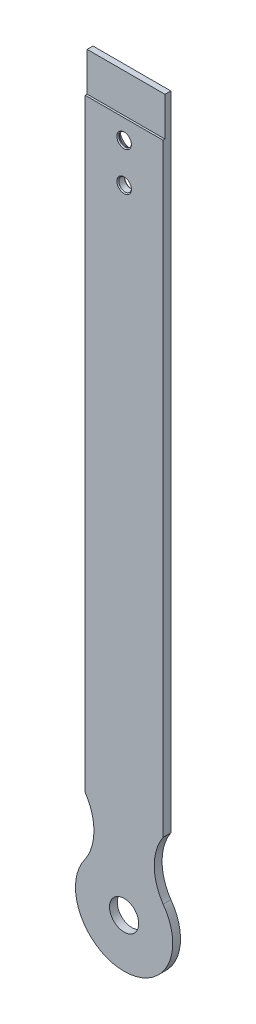
ISO-10303-21;
HEADER;
FILE_DESCRIPTION(('STEP AP214'),'2;1');
FILE_NAME('part.step','',(''),(''),'','','');
FILE_SCHEMA(('AUTOMOTIVE_DESIGN { 1 0 10303 214 1 1 1 1 }'));
ENDSEC;
DATA;
#1=APPLICATION_CONTEXT('core data for automotive mechanical design processes');
#2=APPLICATION_PROTOCOL_DEFINITION('international standard','automotive_design',2000,#1);
#3=PRODUCT_CONTEXT('',#1,'mechanical');
#4=PRODUCT('Part','Part','',(#3));
#5=PRODUCT_RELATED_PRODUCT_CATEGORY('part','',(#4));
#6=PRODUCT_DEFINITION_FORMATION('','',#4);
#7=PRODUCT_DEFINITION_CONTEXT('part definition',#1,'design');
#8=PRODUCT_DEFINITION('design','',#6,#7);
#9=PRODUCT_DEFINITION_SHAPE('','',#8);
#10=(LENGTH_UNIT() NAMED_UNIT(*) SI_UNIT(.MILLI.,.METRE.));
#11=(NAMED_UNIT(*) PLANE_ANGLE_UNIT() SI_UNIT($,.RADIAN.));
#12=(NAMED_UNIT(*) SI_UNIT($,.STERADIAN.) SOLID_ANGLE_UNIT());
#13=UNCERTAINTY_MEASURE_WITH_UNIT(LENGTH_MEASURE(1.E-05),#10,'distance_accuracy_value','');
#14=(GEOMETRIC_REPRESENTATION_CONTEXT(3) GLOBAL_UNCERTAINTY_ASSIGNED_CONTEXT((#13)) GLOBAL_UNIT_ASSIGNED_CONTEXT((#10,
#11,#12)) REPRESENTATION_CONTEXT('',''));
#15=CARTESIAN_POINT('',(0.,0.,0.));
#16=DIRECTION('',(0.,0.,1.));
#17=DIRECTION('',(1.,0.,0.));
#18=AXIS2_PLACEMENT_3D('',#15,#16,#17);
#19=CARTESIAN_POINT('',(42.1304076444806,54.8189772070742,4.));
#20=DIRECTION('',(0.,0.,-1.));
#21=DIRECTION('',(-1.,0.,0.));
#22=AXIS2_PLACEMENT_3D('',#19,#20,#21);
#23=PLANE('',#22);
#24=CARTESIAN_POINT('',(0.,370.,4.));
#25=DIRECTION('',(0.,0.,-1.));
#26=DIRECTION('',(-1.,0.,0.));
#27=AXIS2_PLACEMENT_3D('',#24,#25,#26);
#28=CIRCLE('',#27,3.75000000000003);
#29=CARTESIAN_POINT('',(-3.75000000000004,370.,4.));
#30=VERTEX_POINT('',#29);
#31=EDGE_CURVE('E159',#30,#30,#28,.T.);
#32=ORIENTED_EDGE('',*,*,#31,.T.);
#33=EDGE_LOOP('',(#32));
#34=FACE_BOUND('',#33,.T.);
#35=CARTESIAN_POINT('',(0.,350.,4.));
#36=DIRECTION('',(0.,0.,-1.));
#37=DIRECTION('',(-1.,0.,0.));
#38=AXIS2_PLACEMENT_3D('',#35,#36,#37);
#39=CIRCLE('',#38,3.75000000000003);
#40=CARTESIAN_POINT('',(-3.75000000000004,350.,4.));
#41=VERTEX_POINT('',#40);
#42=EDGE_CURVE('E156',#41,#41,#39,.T.);
#43=ORIENTED_EDGE('',*,*,#42,.T.);
#44=EDGE_LOOP('',(#43));
#45=FACE_BOUND('',#44,.T.);
#46=DIRECTION('',(0.,1.,0.));
#47=VECTOR('',#46,1.);
#48=CARTESIAN_POINT('',(20.,69.6290435082364,4.));
#49=LINE('',#48,#47);
#50=CARTESIAN_POINT('',(20.,69.6290435082364,4.));
#51=VERTEX_POINT('',#50);
#52=CARTESIAN_POINT('',(20.,380.056352187278,4.));
#53=VERTEX_POINT('',#52);
#54=EDGE_CURVE('E127',#51,#53,#49,.T.);
#55=ORIENTED_EDGE('',*,*,#54,.T.);
#56=DIRECTION('',(-1.,0.,0.));
#57=VECTOR('',#56,1.);
#58=CARTESIAN_POINT('',(25.0000000000001,380.056352187278,4.));
#59=LINE('',#58,#57);
#60=CARTESIAN_POINT('',(-20.0000000000001,380.056352187278,4.));
#61=VERTEX_POINT('',#60);
#62=EDGE_CURVE('E261',#53,#61,#59,.T.);
#63=ORIENTED_EDGE('',*,*,#62,.T.);
#64=DIRECTION('',(0.,-1.,0.));
#65=VECTOR('',#64,1.);
#66=CARTESIAN_POINT('',(-20.,69.6290435082364,4.));
#67=LINE('',#66,#65);
#68=CARTESIAN_POINT('',(-20.,69.6290435082364,4.));
#69=VERTEX_POINT('',#68);
#70=EDGE_CURVE('E94',#61,#69,#67,.T.);
#71=ORIENTED_EDGE('',*,*,#70,.T.);
#72=CARTESIAN_POINT('',(-42.1304076444805,54.8189772070742,4.));
#73=DIRECTION('',(0.,0.,-1.));
#74=DIRECTION('',(1.,0.,0.));
#75=AXIS2_PLACEMENT_3D('',#72,#73,#74);
#76=CIRCLE('',#75,26.6288003176204);
#77=CARTESIAN_POINT('',(-20.0598516302376,39.9198643617445,4.));
#78=VERTEX_POINT('',#77);
#79=EDGE_CURVE('E249',#69,#78,#76,.T.);
#80=ORIENTED_EDGE('',*,*,#79,.T.);
#81=CARTESIAN_POINT('',(0.,25.,4.));
#82=DIRECTION('',(0.,0.,1.));
#83=DIRECTION('',(1.,0.,0.));
#84=AXIS2_PLACEMENT_3D('',#81,#82,#83);
#85=CIRCLE('',#84,25.);
#86=CARTESIAN_POINT('',(20.0598516302377,39.9198643617445,4.));
#87=VERTEX_POINT('',#86);
#88=EDGE_CURVE('E251',#78,#87,#85,.T.);
#89=ORIENTED_EDGE('',*,*,#88,.T.);
#90=CARTESIAN_POINT('',(42.1304076444806,54.8189772070742,4.));
#91=DIRECTION('',(0.,0.,-1.));
#92=DIRECTION('',(-1.,0.,0.));
#93=AXIS2_PLACEMENT_3D('',#90,#91,#92);
#94=CIRCLE('',#93,26.6288003176205);
#95=EDGE_CURVE('E59',#87,#51,#94,.T.);
#96=ORIENTED_EDGE('',*,*,#95,.T.);
#97=EDGE_LOOP('',(#55,#63,#71,#80,#89,#96));
#98=FACE_BOUND('',#97,.T.);
#99=CARTESIAN_POINT('',(0.,25.,4.));
#100=DIRECTION('',(0.,0.,1.));
#101=DIRECTION('',(1.,0.,0.));
#102=AXIS2_PLACEMENT_3D('',#99,#100,#101);
#103=CIRCLE('',#102,7.5);
#104=CARTESIAN_POINT('',(7.50000000000005,25.,4.));
#105=VERTEX_POINT('',#104);
#106=EDGE_CURVE('E237',#105,#105,#103,.T.);
#107=ORIENTED_EDGE('',*,*,#106,.F.);
#108=EDGE_LOOP('',(#107));
#109=FACE_BOUND('',#108,.T.);
#110=ADVANCED_FACE('F35',(#34,#45,#98,#109),#23,.F.);
#111=CARTESIAN_POINT('',(42.1304076444806,54.8189772070742,0.));
#112=DIRECTION('',(0.,0.,-1.));
#113=DIRECTION('',(-1.,0.,0.));
#114=AXIS2_PLACEMENT_3D('',#111,#112,#113);
#115=PLANE('',#114);
#116=CARTESIAN_POINT('',(0.,350.,0.));
#117=DIRECTION('',(0.,0.,-1.));
#118=DIRECTION('',(-1.,0.,0.));
#119=AXIS2_PLACEMENT_3D('',#116,#117,#118);
#120=CIRCLE('',#119,3.74999999999998);
#121=CARTESIAN_POINT('',(-3.74999999999998,350.,0.));
#122=VERTEX_POINT('',#121);
#123=EDGE_CURVE('E11',#122,#122,#120,.F.);
#124=ORIENTED_EDGE('',*,*,#123,.T.);
#125=EDGE_LOOP('',(#124));
#126=FACE_BOUND('',#125,.T.);
#127=CARTESIAN_POINT('',(0.,370.,0.));
#128=DIRECTION('',(0.,0.,-1.));
#129=DIRECTION('',(-1.,0.,0.));
#130=AXIS2_PLACEMENT_3D('',#127,#128,#129);
#131=CIRCLE('',#130,6.25000000000009);
#132=CARTESIAN_POINT('',(-6.25000000000009,370.,0.));
#133=VERTEX_POINT('',#132);
#134=EDGE_CURVE('E147',#133,#133,#131,.F.);
#135=ORIENTED_EDGE('',*,*,#134,.T.);
#136=EDGE_LOOP('',(#135));
#137=FACE_BOUND('',#136,.T.);
#138=CARTESIAN_POINT('',(0.,25.,0.));
#139=DIRECTION('',(0.,0.,1.));
#140=DIRECTION('',(1.,0.,0.));
#141=AXIS2_PLACEMENT_3D('',#138,#139,#140);
#142=CIRCLE('',#141,7.5);
#143=CARTESIAN_POINT('',(7.50000000000005,25.,0.));
#144=VERTEX_POINT('',#143);
#145=EDGE_CURVE('E231',#144,#144,#142,.T.);
#146=ORIENTED_EDGE('',*,*,#145,.T.);
#147=EDGE_LOOP('',(#146));
#148=FACE_BOUND('',#147,.T.);
#149=DIRECTION('',(0.,-1.,0.));
#150=VECTOR('',#149,1.);
#151=CARTESIAN_POINT('',(-20.,69.6290435082364,0.));
#152=LINE('',#151,#150);
#153=CARTESIAN_POINT('',(-20.,400.,0.));
#154=VERTEX_POINT('',#153);
#155=CARTESIAN_POINT('',(-20.,69.6290435082364,0.));
#156=VERTEX_POINT('',#155);
#157=EDGE_CURVE('E232',#154,#156,#152,.T.);
#158=ORIENTED_EDGE('',*,*,#157,.F.);
#159=DIRECTION('',(-1.,0.,0.));
#160=VECTOR('',#159,1.);
#161=CARTESIAN_POINT('',(20.,400.,0.));
#162=LINE('',#161,#160);
#163=CARTESIAN_POINT('',(20.,400.,0.));
#164=VERTEX_POINT('',#163);
#165=EDGE_CURVE('E124',#164,#154,#162,.T.);
#166=ORIENTED_EDGE('',*,*,#165,.F.);
#167=DIRECTION('',(0.,1.,0.));
#168=VECTOR('',#167,1.);
#169=CARTESIAN_POINT('',(20.,69.6290435082364,0.));
#170=LINE('',#169,#168);
#171=CARTESIAN_POINT('',(20.,69.6290435082364,0.));
#172=VERTEX_POINT('',#171);
#173=EDGE_CURVE('E247',#172,#164,#170,.T.);
#174=ORIENTED_EDGE('',*,*,#173,.F.);
#175=CARTESIAN_POINT('',(42.1304076444806,54.8189772070742,0.));
#176=DIRECTION('',(0.,0.,-1.));
#177=DIRECTION('',(-1.,0.,0.));
#178=AXIS2_PLACEMENT_3D('',#175,#176,#177);
#179=CIRCLE('',#178,26.6288003176205);
#180=CARTESIAN_POINT('',(20.0598516302377,39.9198643617445,0.));
#181=VERTEX_POINT('',#180);
#182=EDGE_CURVE('E246',#181,#172,#179,.T.);
#183=ORIENTED_EDGE('',*,*,#182,.F.);
#184=CARTESIAN_POINT('',(0.,25.,0.));
#185=DIRECTION('',(0.,0.,1.));
#186=DIRECTION('',(1.,0.,0.));
#187=AXIS2_PLACEMENT_3D('',#184,#185,#186);
#188=CIRCLE('',#187,25.);
#189=CARTESIAN_POINT('',(-20.0598516302376,39.9198643617445,0.));
#190=VERTEX_POINT('',#189);
#191=EDGE_CURVE('E239',#190,#181,#188,.T.);
#192=ORIENTED_EDGE('',*,*,#191,.F.);
#193=CARTESIAN_POINT('',(-42.1304076444805,54.8189772070742,0.));
#194=DIRECTION('',(0.,0.,-1.));
#195=DIRECTION('',(1.,0.,0.));
#196=AXIS2_PLACEMENT_3D('',#193,#194,#195);
#197=CIRCLE('',#196,26.6288003176204);
#198=EDGE_CURVE('E235',#156,#190,#197,.T.);
#199=ORIENTED_EDGE('',*,*,#198,.F.);
#200=EDGE_LOOP('',(#158,#166,#174,#183,#192,#199));
#201=FACE_BOUND('',#200,.T.);
#202=ADVANCED_FACE('F184',(#126,#137,#148,#201),#115,.T.);
#203=CARTESIAN_POINT('',(-20.,69.6290435082364,4.));
#204=DIRECTION('',(1.,0.,0.));
#205=DIRECTION('',(0.,1.,0.));
#206=AXIS2_PLACEMENT_3D('',#203,#204,#205);
#207=PLANE('',#206);
#208=ORIENTED_EDGE('',*,*,#70,.F.);
#209=DIRECTION('',(0.,0.,1.));
#210=VECTOR('',#209,1.);
#211=CARTESIAN_POINT('',(-20.0000000000001,380.056352187278,3.));
#212=LINE('',#211,#210);
#213=CARTESIAN_POINT('',(-20.0000000000001,380.056352187278,3.));
#214=VERTEX_POINT('',#213);
#215=EDGE_CURVE('E120',#214,#61,#212,.T.);
#216=ORIENTED_EDGE('',*,*,#215,.F.);
#217=DIRECTION('',(0.,-1.,0.));
#218=VECTOR('',#217,1.);
#219=CARTESIAN_POINT('',(-20.0000000000001,400.,3.));
#220=LINE('',#219,#218);
#221=CARTESIAN_POINT('',(-20.0000000000001,400.,3.));
#222=VERTEX_POINT('',#221);
#223=EDGE_CURVE('E112',#222,#214,#220,.T.);
#224=ORIENTED_EDGE('',*,*,#223,.F.);
#225=DIRECTION('',(0.,0.,-1.));
#226=VECTOR('',#225,1.);
#227=CARTESIAN_POINT('',(-20.,400.,4.));
#228=LINE('',#227,#226);
#229=EDGE_CURVE('E87',#222,#154,#228,.T.);
#230=ORIENTED_EDGE('',*,*,#229,.T.);
#231=ORIENTED_EDGE('',*,*,#157,.T.);
#232=DIRECTION('',(0.,0.,-1.));
#233=VECTOR('',#232,1.);
#234=CARTESIAN_POINT('',(-20.,69.6290435082364,4.));
#235=LINE('',#234,#233);
#236=EDGE_CURVE('E117',#69,#156,#235,.T.);
#237=ORIENTED_EDGE('',*,*,#236,.F.);
#238=EDGE_LOOP('',(#208,#216,#224,#230,#231,#237));
#239=FACE_BOUND('',#238,.T.);
#240=ADVANCED_FACE('F119',(#239),#207,.F.);
#241=CARTESIAN_POINT('',(-42.1304076444805,54.8189772070742,4.));
#242=DIRECTION('',(0.,0.,-1.));
#243=DIRECTION('',(-1.,0.,0.));
#244=AXIS2_PLACEMENT_3D('',#241,#242,#243);
#245=CYLINDRICAL_SURFACE('',#244,26.6288003176204);
#246=ORIENTED_EDGE('',*,*,#198,.T.);
#247=DIRECTION('',(0.,0.,-1.));
#248=VECTOR('',#247,1.);
#249=CARTESIAN_POINT('',(-20.0598516302376,39.9198643617445,4.));
#250=LINE('',#249,#248);
#251=EDGE_CURVE('E140',#78,#190,#250,.T.);
#252=ORIENTED_EDGE('',*,*,#251,.F.);
#253=ORIENTED_EDGE('',*,*,#79,.F.);
#254=ORIENTED_EDGE('',*,*,#236,.T.);
#255=EDGE_LOOP('',(#246,#252,#253,#254));
#256=FACE_BOUND('',#255,.T.);
#257=ADVANCED_FACE('F209',(#256),#245,.F.);
#258=CARTESIAN_POINT('',(0.,25.,4.));
#259=DIRECTION('',(0.,0.,-1.));
#260=DIRECTION('',(-1.,0.,0.));
#261=AXIS2_PLACEMENT_3D('',#258,#259,#260);
#262=CYLINDRICAL_SURFACE('',#261,25.);
#263=ORIENTED_EDGE('',*,*,#191,.T.);
#264=DIRECTION('',(0.,0.,-1.));
#265=VECTOR('',#264,1.);
#266=CARTESIAN_POINT('',(20.0598516302377,39.9198643617445,4.));
#267=LINE('',#266,#265);
#268=EDGE_CURVE('E137',#87,#181,#267,.T.);
#269=ORIENTED_EDGE('',*,*,#268,.F.);
#270=ORIENTED_EDGE('',*,*,#88,.F.);
#271=ORIENTED_EDGE('',*,*,#251,.T.);
#272=EDGE_LOOP('',(#263,#269,#270,#271));
#273=FACE_BOUND('',#272,.T.);
#274=ADVANCED_FACE('F205',(#273),#262,.T.);
#275=CARTESIAN_POINT('',(42.1304076444806,54.8189772070742,4.));
#276=DIRECTION('',(0.,0.,-1.));
#277=DIRECTION('',(-1.,0.,0.));
#278=AXIS2_PLACEMENT_3D('',#275,#276,#277);
#279=CYLINDRICAL_SURFACE('',#278,26.6288003176205);
#280=ORIENTED_EDGE('',*,*,#182,.T.);
#281=DIRECTION('',(0.,0.,-1.));
#282=VECTOR('',#281,1.);
#283=CARTESIAN_POINT('',(20.,69.6290435082364,4.));
#284=LINE('',#283,#282);
#285=EDGE_CURVE('E129',#51,#172,#284,.T.);
#286=ORIENTED_EDGE('',*,*,#285,.F.);
#287=ORIENTED_EDGE('',*,*,#95,.F.);
#288=ORIENTED_EDGE('',*,*,#268,.T.);
#289=EDGE_LOOP('',(#280,#286,#287,#288));
#290=FACE_BOUND('',#289,.T.);
#291=ADVANCED_FACE('F201',(#290),#279,.F.);
#292=CARTESIAN_POINT('',(20.,69.6290435082364,4.));
#293=DIRECTION('',(-1.,0.,0.));
#294=DIRECTION('',(0.,-1.,0.));
#295=AXIS2_PLACEMENT_3D('',#292,#293,#294);
#296=PLANE('',#295);
#297=DIRECTION('',(0.,-1.,0.));
#298=VECTOR('',#297,1.);
#299=CARTESIAN_POINT('',(20.,69.6290435082364,3.00000000000004));
#300=LINE('',#299,#298);
#301=CARTESIAN_POINT('',(20.,400.,3.));
#302=VERTEX_POINT('',#301);
#303=CARTESIAN_POINT('',(20.,380.056352187278,3.));
#304=VERTEX_POINT('',#303);
#305=EDGE_CURVE('E50',#302,#304,#300,.T.);
#306=ORIENTED_EDGE('',*,*,#305,.T.);
#307=DIRECTION('',(0.,0.,1.));
#308=VECTOR('',#307,1.);
#309=CARTESIAN_POINT('',(20.,380.056352187278,4.));
#310=LINE('',#309,#308);
#311=EDGE_CURVE('E116',#304,#53,#310,.T.);
#312=ORIENTED_EDGE('',*,*,#311,.T.);
#313=ORIENTED_EDGE('',*,*,#54,.F.);
#314=ORIENTED_EDGE('',*,*,#285,.T.);
#315=ORIENTED_EDGE('',*,*,#173,.T.);
#316=DIRECTION('',(0.,0.,-1.));
#317=VECTOR('',#316,1.);
#318=CARTESIAN_POINT('',(20.,400.,4.));
#319=LINE('',#318,#317);
#320=EDGE_CURVE('E126',#302,#164,#319,.T.);
#321=ORIENTED_EDGE('',*,*,#320,.F.);
#322=EDGE_LOOP('',(#306,#312,#313,#314,#315,#321));
#323=FACE_BOUND('',#322,.T.);
#324=ADVANCED_FACE('F198',(#323),#296,.F.);
#325=CARTESIAN_POINT('',(20.,400.,4.));
#326=DIRECTION('',(0.,-1.,0.));
#327=DIRECTION('',(0.,0.,-1.));
#328=AXIS2_PLACEMENT_3D('',#325,#326,#327);
#329=PLANE('',#328);
#330=ORIENTED_EDGE('',*,*,#229,.F.);
#331=DIRECTION('',(1.,0.,0.));
#332=VECTOR('',#331,1.);
#333=CARTESIAN_POINT('',(20.,400.,3.));
#334=LINE('',#333,#332);
#335=EDGE_CURVE('E110',#222,#302,#334,.T.);
#336=ORIENTED_EDGE('',*,*,#335,.T.);
#337=ORIENTED_EDGE('',*,*,#320,.T.);
#338=ORIENTED_EDGE('',*,*,#165,.T.);
#339=EDGE_LOOP('',(#330,#336,#337,#338));
#340=FACE_BOUND('',#339,.T.);
#341=ADVANCED_FACE('F122',(#340),#329,.F.);
#342=CARTESIAN_POINT('',(0.,350.,4.));
#343=DIRECTION('',(0.,0.,-1.));
#344=DIRECTION('',(-1.,0.,0.));
#345=AXIS2_PLACEMENT_3D('',#342,#343,#344);
#346=CYLINDRICAL_SURFACE('',#345,3.25);
#347=CARTESIAN_POINT('',(0.,350.,3.4999999999999));
#348=DIRECTION('',(0.,0.,-1.));
#349=DIRECTION('',(-1.,0.,0.));
#350=AXIS2_PLACEMENT_3D('',#347,#348,#349);
#351=CIRCLE('',#350,3.25);
#352=CARTESIAN_POINT('',(-3.25,350.,3.4999999999999));
#353=VERTEX_POINT('',#352);
#354=EDGE_CURVE('E43',#353,#353,#351,.F.);
#355=ORIENTED_EDGE('',*,*,#354,.T.);
#356=EDGE_LOOP('',(#355));
#357=FACE_BOUND('',#356,.T.);
#358=CARTESIAN_POINT('',(0.,350.,0.500000000000019));
#359=DIRECTION('',(0.,0.,-1.));
#360=DIRECTION('',(-1.,0.,0.));
#361=AXIS2_PLACEMENT_3D('',#358,#359,#360);
#362=CIRCLE('',#361,3.25);
#363=CARTESIAN_POINT('',(-3.25,350.,0.500000000000019));
#364=VERTEX_POINT('',#363);
#365=EDGE_CURVE('E162',#364,#364,#362,.T.);
#366=ORIENTED_EDGE('',*,*,#365,.T.);
#367=EDGE_LOOP('',(#366));
#368=FACE_BOUND('',#367,.T.);
#369=ADVANCED_FACE('F167',(#357,#368),#346,.F.);
#370=CARTESIAN_POINT('',(0.,25.,4.));
#371=DIRECTION('',(0.,0.,-1.));
#372=DIRECTION('',(-1.,0.,0.));
#373=AXIS2_PLACEMENT_3D('',#370,#371,#372);
#374=CYLINDRICAL_SURFACE('',#373,7.5);
#375=ORIENTED_EDGE('',*,*,#106,.T.);
#376=EDGE_LOOP('',(#375));
#377=FACE_BOUND('',#376,.T.);
#378=ORIENTED_EDGE('',*,*,#145,.F.);
#379=EDGE_LOOP('',(#378));
#380=FACE_BOUND('',#379,.T.);
#381=ADVANCED_FACE('F274',(#377,#380),#374,.F.);
#382=CARTESIAN_POINT('',(0.,370.,4.));
#383=DIRECTION('',(0.,0.,-1.));
#384=DIRECTION('',(-1.,0.,0.));
#385=AXIS2_PLACEMENT_3D('',#382,#383,#384);
#386=CYLINDRICAL_SURFACE('',#385,3.25);
#387=CARTESIAN_POINT('',(0.,370.,3.4999999999999));
#388=DIRECTION('',(0.,0.,-1.));
#389=DIRECTION('',(-1.,0.,0.));
#390=AXIS2_PLACEMENT_3D('',#387,#388,#389);
#391=CIRCLE('',#390,3.25);
#392=CARTESIAN_POINT('',(-3.25,370.,3.4999999999999));
#393=VERTEX_POINT('',#392);
#394=EDGE_CURVE('E153',#393,#393,#391,.F.);
#395=ORIENTED_EDGE('',*,*,#394,.T.);
#396=EDGE_LOOP('',(#395));
#397=FACE_BOUND('',#396,.T.);
#398=CARTESIAN_POINT('',(0.,370.,3.00000000000008));
#399=DIRECTION('',(0.,0.,-1.));
#400=DIRECTION('',(-1.,0.,0.));
#401=AXIS2_PLACEMENT_3D('',#398,#399,#400);
#402=CIRCLE('',#401,3.25);
#403=CARTESIAN_POINT('',(-3.25,370.,3.00000000000008));
#404=VERTEX_POINT('',#403);
#405=EDGE_CURVE('E150',#404,#404,#402,.T.);
#406=ORIENTED_EDGE('',*,*,#405,.T.);
#407=EDGE_LOOP('',(#406));
#408=FACE_BOUND('',#407,.T.);
#409=ADVANCED_FACE('F269',(#397,#408),#386,.F.);
#410=CARTESIAN_POINT('',(25.0000000000001,380.056352187278,3.));
#411=DIRECTION('',(0.,-1.,0.));
#412=DIRECTION('',(1.,0.,0.));
#413=AXIS2_PLACEMENT_3D('',#410,#411,#412);
#414=PLANE('',#413);
#415=DIRECTION('',(-1.,0.,0.));
#416=VECTOR('',#415,1.);
#417=CARTESIAN_POINT('',(25.0000000000001,380.056352187278,3.));
#418=LINE('',#417,#416);
#419=EDGE_CURVE('E263',#304,#214,#418,.T.);
#420=ORIENTED_EDGE('',*,*,#419,.T.);
#421=ORIENTED_EDGE('',*,*,#215,.T.);
#422=ORIENTED_EDGE('',*,*,#62,.F.);
#423=ORIENTED_EDGE('',*,*,#311,.F.);
#424=EDGE_LOOP('',(#420,#421,#422,#423));
#425=FACE_BOUND('',#424,.T.);
#426=ADVANCED_FACE('F221',(#425),#414,.F.);
#427=CARTESIAN_POINT('',(25.0000000000001,400.,3.));
#428=DIRECTION('',(0.,0.,-1.));
#429=DIRECTION('',(0.,1.,0.));
#430=AXIS2_PLACEMENT_3D('',#427,#428,#429);
#431=PLANE('',#430);
#432=ORIENTED_EDGE('',*,*,#335,.F.);
#433=ORIENTED_EDGE('',*,*,#223,.T.);
#434=ORIENTED_EDGE('',*,*,#419,.F.);
#435=ORIENTED_EDGE('',*,*,#305,.F.);
#436=EDGE_LOOP('',(#432,#433,#434,#435));
#437=FACE_BOUND('',#436,.T.);
#438=ADVANCED_FACE('F111',(#437),#431,.F.);
#439=CARTESIAN_POINT('',(0.,370.,0.));
#440=DIRECTION('',(0.,0.,-1.));
#441=DIRECTION('',(-1.,0.,0.));
#442=AXIS2_PLACEMENT_3D('',#439,#440,#441);
#443=CONICAL_SURFACE('',#442,6.25000000000009,0.78539816339745);
#444=ORIENTED_EDGE('',*,*,#405,.F.);
#445=EDGE_LOOP('',(#444));
#446=FACE_BOUND('',#445,.T.);
#447=ORIENTED_EDGE('',*,*,#134,.F.);
#448=EDGE_LOOP('',(#447));
#449=FACE_BOUND('',#448,.T.);
#450=ADVANCED_FACE('F179',(#446,#449),#443,.F.);
#451=CARTESIAN_POINT('',(0.,370.,3.4999999999999));
#452=DIRECTION('',(0.,0.,1.));
#453=DIRECTION('',(1.,0.,0.));
#454=AXIS2_PLACEMENT_3D('',#451,#452,#453);
#455=CONICAL_SURFACE('',#454,3.25,0.785398163397382);
#456=ORIENTED_EDGE('',*,*,#31,.F.);
#457=EDGE_LOOP('',(#456));
#458=FACE_BOUND('',#457,.T.);
#459=ORIENTED_EDGE('',*,*,#394,.F.);
#460=EDGE_LOOP('',(#459));
#461=FACE_BOUND('',#460,.T.);
#462=ADVANCED_FACE('F172',(#458,#461),#455,.F.);
#463=CARTESIAN_POINT('',(0.,350.,3.4999999999999));
#464=DIRECTION('',(0.,0.,1.));
#465=DIRECTION('',(1.,0.,0.));
#466=AXIS2_PLACEMENT_3D('',#463,#464,#465);
#467=CONICAL_SURFACE('',#466,3.25,0.785398163397382);
#468=ORIENTED_EDGE('',*,*,#42,.F.);
#469=EDGE_LOOP('',(#468));
#470=FACE_BOUND('',#469,.T.);
#471=ORIENTED_EDGE('',*,*,#354,.F.);
#472=EDGE_LOOP('',(#471));
#473=FACE_BOUND('',#472,.T.);
#474=ADVANCED_FACE('F170',(#470,#473),#467,.F.);
#475=CARTESIAN_POINT('',(0.,350.,0.));
#476=DIRECTION('',(0.,0.,-1.));
#477=DIRECTION('',(-1.,0.,0.));
#478=AXIS2_PLACEMENT_3D('',#475,#476,#477);
#479=CONICAL_SURFACE('',#478,3.74999999999998,0.785398163397404);
#480=ORIENTED_EDGE('',*,*,#365,.F.);
#481=EDGE_LOOP('',(#480));
#482=FACE_BOUND('',#481,.T.);
#483=ORIENTED_EDGE('',*,*,#123,.F.);
#484=EDGE_LOOP('',(#483));
#485=FACE_BOUND('',#484,.T.);
#486=ADVANCED_FACE('F37',(#482,#485),#479,.F.);
#487=CLOSED_SHELL('',(#110,#202,#240,#257,#274,#291,#324,#341,#369,#381,#409,#426,#438,#450,
#462,#474,#486));
#488=MANIFOLD_SOLID_BREP('B2',#487);
#489=ADVANCED_BREP_SHAPE_REPRESENTATION('',(#18,#488),#14);
#490=SHAPE_DEFINITION_REPRESENTATION(#9,#489);
ENDSEC;
END-ISO-10303-21;
